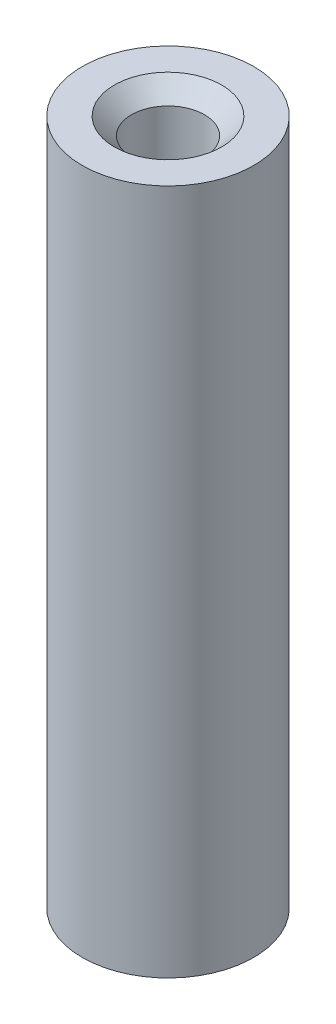
ISO-10303-21;
HEADER;
FILE_DESCRIPTION(('STEP AP214'),'2;1');
FILE_NAME('part.step','',(''),(''),'','','');
FILE_SCHEMA(('AUTOMOTIVE_DESIGN { 1 0 10303 214 1 1 1 1 }'));
ENDSEC;
DATA;
#1=APPLICATION_CONTEXT('core data for automotive mechanical design processes');
#2=APPLICATION_PROTOCOL_DEFINITION('international standard','automotive_design',2000,#1);
#3=PRODUCT_CONTEXT('',#1,'mechanical');
#4=PRODUCT('Part','Part','',(#3));
#5=PRODUCT_RELATED_PRODUCT_CATEGORY('part','',(#4));
#6=PRODUCT_DEFINITION_FORMATION('','',#4);
#7=PRODUCT_DEFINITION_CONTEXT('part definition',#1,'design');
#8=PRODUCT_DEFINITION('design','',#6,#7);
#9=PRODUCT_DEFINITION_SHAPE('','',#8);
#10=(LENGTH_UNIT() NAMED_UNIT(*) SI_UNIT(.MILLI.,.METRE.));
#11=(NAMED_UNIT(*) PLANE_ANGLE_UNIT() SI_UNIT($,.RADIAN.));
#12=(NAMED_UNIT(*) SI_UNIT($,.STERADIAN.) SOLID_ANGLE_UNIT());
#13=UNCERTAINTY_MEASURE_WITH_UNIT(LENGTH_MEASURE(1.E-05),#10,'distance_accuracy_value','');
#14=(GEOMETRIC_REPRESENTATION_CONTEXT(3) GLOBAL_UNCERTAINTY_ASSIGNED_CONTEXT((#13)) GLOBAL_UNIT_ASSIGNED_CONTEXT((#10,
#11,#12)) REPRESENTATION_CONTEXT('',''));
#15=CARTESIAN_POINT('',(0.,0.,0.));
#16=DIRECTION('',(0.,0.,1.));
#17=DIRECTION('',(1.,0.,0.));
#18=AXIS2_PLACEMENT_3D('',#15,#16,#17);
#19=CARTESIAN_POINT('',(0.,25.4,0.));
#20=DIRECTION('',(0.,-1.,0.));
#21=DIRECTION('',(0.,0.,-1.));
#22=AXIS2_PLACEMENT_3D('',#19,#20,#21);
#23=CYLINDRICAL_SURFACE('',#22,3.175);
#24=CARTESIAN_POINT('',(0.,25.4,0.));
#25=DIRECTION('',(0.,1.,0.));
#26=DIRECTION('',(0.,0.,1.));
#27=AXIS2_PLACEMENT_3D('',#24,#25,#26);
#28=CIRCLE('',#27,3.175);
#29=CARTESIAN_POINT('',(0.,25.4,3.175));
#30=VERTEX_POINT('',#29);
#31=EDGE_CURVE('E10',#30,#30,#28,.T.);
#32=ORIENTED_EDGE('',*,*,#31,.F.);
#33=EDGE_LOOP('',(#32));
#34=FACE_BOUND('',#33,.T.);
#35=CARTESIAN_POINT('',(0.,0.,0.));
#36=DIRECTION('',(0.,1.,0.));
#37=DIRECTION('',(0.,0.,1.));
#38=AXIS2_PLACEMENT_3D('',#35,#36,#37);
#39=CIRCLE('',#38,3.175);
#40=CARTESIAN_POINT('',(0.,0.,3.175));
#41=VERTEX_POINT('',#40);
#42=EDGE_CURVE('E34',#41,#41,#39,.T.);
#43=ORIENTED_EDGE('',*,*,#42,.T.);
#44=EDGE_LOOP('',(#43));
#45=FACE_BOUND('',#44,.T.);
#46=ADVANCED_FACE('F31',(#34,#45),#23,.T.);
#47=CARTESIAN_POINT('',(0.,25.4,0.));
#48=DIRECTION('',(0.,1.,0.));
#49=DIRECTION('',(0.,0.,1.));
#50=AXIS2_PLACEMENT_3D('',#47,#48,#49);
#51=PLANE('',#50);
#52=CARTESIAN_POINT('',(0.,25.4,0.));
#53=DIRECTION('',(0.,1.,0.));
#54=DIRECTION('',(0.,0.,1.));
#55=AXIS2_PLACEMENT_3D('',#52,#53,#54);
#56=CIRCLE('',#55,1.98755);
#57=CARTESIAN_POINT('',(0.,25.4,1.98755));
#58=VERTEX_POINT('',#57);
#59=EDGE_CURVE('E48',#58,#58,#56,.T.);
#60=ORIENTED_EDGE('',*,*,#59,.F.);
#61=EDGE_LOOP('',(#60));
#62=FACE_BOUND('',#61,.T.);
#63=ORIENTED_EDGE('',*,*,#31,.T.);
#64=EDGE_LOOP('',(#63));
#65=FACE_BOUND('',#64,.T.);
#66=ADVANCED_FACE('F76',(#62,#65),#51,.T.);
#67=CARTESIAN_POINT('',(0.,0.,0.));
#68=DIRECTION('',(0.,1.,0.));
#69=DIRECTION('',(0.,0.,1.));
#70=AXIS2_PLACEMENT_3D('',#67,#68,#69);
#71=PLANE('',#70);
#72=CARTESIAN_POINT('',(0.,0.,0.));
#73=DIRECTION('',(0.,1.,0.));
#74=DIRECTION('',(0.,0.,1.));
#75=AXIS2_PLACEMENT_3D('',#72,#73,#74);
#76=CIRCLE('',#75,1.98754999999999);
#77=CARTESIAN_POINT('',(0.,0.,1.98754999999999));
#78=VERTEX_POINT('',#77);
#79=EDGE_CURVE('E51',#78,#78,#76,.T.);
#80=ORIENTED_EDGE('',*,*,#79,.T.);
#81=EDGE_LOOP('',(#80));
#82=FACE_BOUND('',#81,.T.);
#83=ORIENTED_EDGE('',*,*,#42,.F.);
#84=EDGE_LOOP('',(#83));
#85=FACE_BOUND('',#84,.T.);
#86=ADVANCED_FACE('F55',(#82,#85),#71,.F.);
#87=CARTESIAN_POINT('',(0.,0.635000000000004,0.));
#88=DIRECTION('',(0.,-1.,0.));
#89=DIRECTION('',(0.,0.,-1.));
#90=AXIS2_PLACEMENT_3D('',#87,#88,#89);
#91=CONICAL_SURFACE('',#90,1.35254999999999,0.785398163397449);
#92=ORIENTED_EDGE('',*,*,#79,.F.);
#93=EDGE_LOOP('',(#92));
#94=FACE_BOUND('',#93,.T.);
#95=CARTESIAN_POINT('',(0.,0.635000000000004,0.));
#96=DIRECTION('',(0.,1.,0.));
#97=DIRECTION('',(0.,0.,1.));
#98=AXIS2_PLACEMENT_3D('',#95,#96,#97);
#99=CIRCLE('',#98,1.35254999999999);
#100=CARTESIAN_POINT('',(0.,0.635000000000004,1.35254999999999));
#101=VERTEX_POINT('',#100);
#102=EDGE_CURVE('E41',#101,#101,#99,.T.);
#103=ORIENTED_EDGE('',*,*,#102,.T.);
#104=EDGE_LOOP('',(#103));
#105=FACE_BOUND('',#104,.T.);
#106=ADVANCED_FACE('F58',(#94,#105),#91,.F.);
#107=CARTESIAN_POINT('',(0.,25.4,0.));
#108=DIRECTION('',(0.,1.,0.));
#109=DIRECTION('',(0.,0.,1.));
#110=AXIS2_PLACEMENT_3D('',#107,#108,#109);
#111=CYLINDRICAL_SURFACE('',#110,1.35255);
#112=ORIENTED_EDGE('',*,*,#102,.F.);
#113=EDGE_LOOP('',(#112));
#114=FACE_BOUND('',#113,.T.);
#115=CARTESIAN_POINT('',(0.,24.765,0.));
#116=DIRECTION('',(0.,1.,0.));
#117=DIRECTION('',(0.,0.,1.));
#118=AXIS2_PLACEMENT_3D('',#115,#116,#117);
#119=CIRCLE('',#118,1.35255);
#120=CARTESIAN_POINT('',(0.,24.765,1.35255));
#121=VERTEX_POINT('',#120);
#122=EDGE_CURVE('E45',#121,#121,#119,.T.);
#123=ORIENTED_EDGE('',*,*,#122,.T.);
#124=EDGE_LOOP('',(#123));
#125=FACE_BOUND('',#124,.T.);
#126=ADVANCED_FACE('F61',(#114,#125),#111,.F.);
#127=CARTESIAN_POINT('',(0.,25.4,0.));
#128=DIRECTION('',(0.,1.,0.));
#129=DIRECTION('',(0.,0.,1.));
#130=AXIS2_PLACEMENT_3D('',#127,#128,#129);
#131=CONICAL_SURFACE('',#130,1.98755,0.785398163397447);
#132=ORIENTED_EDGE('',*,*,#122,.F.);
#133=EDGE_LOOP('',(#132));
#134=FACE_BOUND('',#133,.T.);
#135=ORIENTED_EDGE('',*,*,#59,.T.);
#136=EDGE_LOOP('',(#135));
#137=FACE_BOUND('',#136,.T.);
#138=ADVANCED_FACE('F67',(#134,#137),#131,.F.);
#139=CLOSED_SHELL('',(#46,#66,#86,#106,#126,#138));
#140=MANIFOLD_SOLID_BREP('B2',#139);
#141=ADVANCED_BREP_SHAPE_REPRESENTATION('',(#18,#140),#14);
#142=SHAPE_DEFINITION_REPRESENTATION(#9,#141);
ENDSEC;
END-ISO-10303-21;
